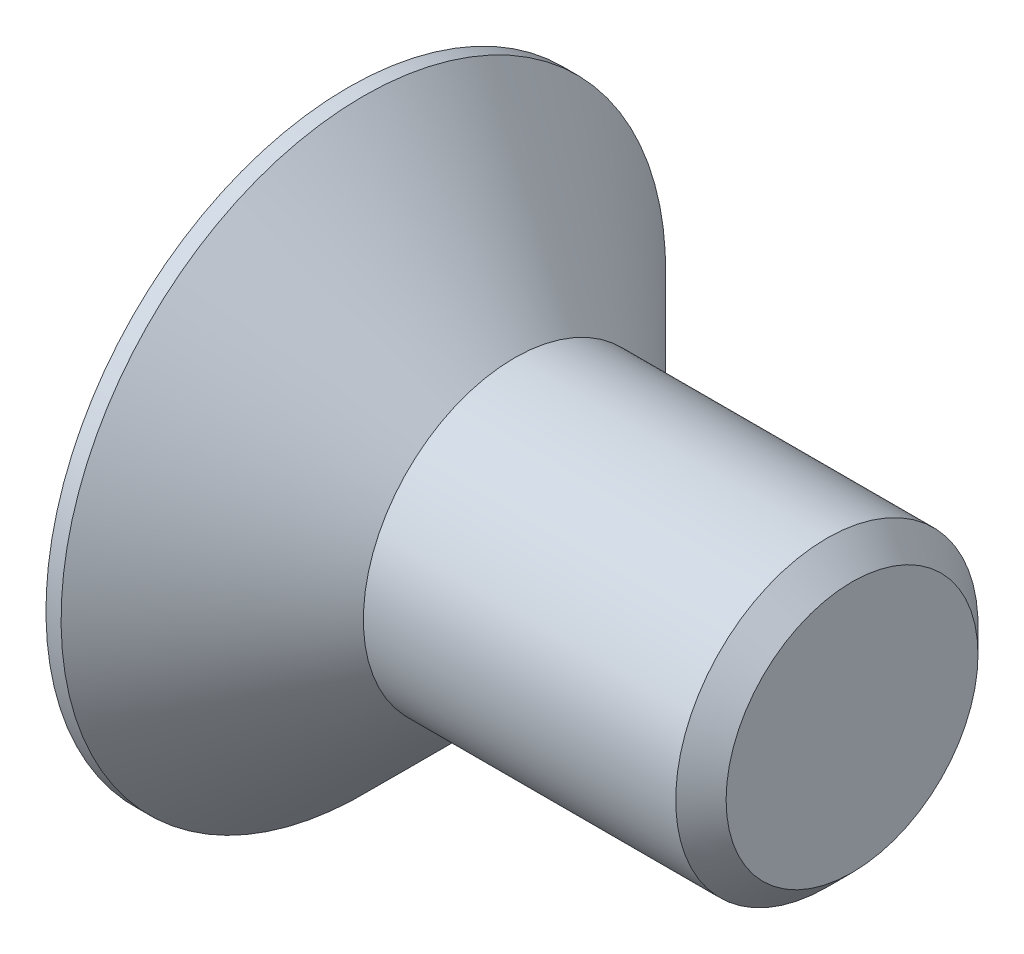
ISO-10303-21;
HEADER;
FILE_DESCRIPTION(('STEP AP214'),'2;1');
FILE_NAME('part.step','',(''),(''),'','','');
FILE_SCHEMA(('AUTOMOTIVE_DESIGN { 1 0 10303 214 1 1 1 1 }'));
ENDSEC;
DATA;
#1=APPLICATION_CONTEXT('core data for automotive mechanical design processes');
#2=APPLICATION_PROTOCOL_DEFINITION('international standard','automotive_design',2000,#1);
#3=PRODUCT_CONTEXT('',#1,'mechanical');
#4=PRODUCT('Part','Part','',(#3));
#5=PRODUCT_RELATED_PRODUCT_CATEGORY('part','',(#4));
#6=PRODUCT_DEFINITION_FORMATION('','',#4);
#7=PRODUCT_DEFINITION_CONTEXT('part definition',#1,'design');
#8=PRODUCT_DEFINITION('design','',#6,#7);
#9=PRODUCT_DEFINITION_SHAPE('','',#8);
#10=(LENGTH_UNIT() NAMED_UNIT(*) SI_UNIT(.MILLI.,.METRE.));
#11=(NAMED_UNIT(*) PLANE_ANGLE_UNIT() SI_UNIT($,.RADIAN.));
#12=(NAMED_UNIT(*) SI_UNIT($,.STERADIAN.) SOLID_ANGLE_UNIT());
#13=UNCERTAINTY_MEASURE_WITH_UNIT(LENGTH_MEASURE(1.E-05),#10,'distance_accuracy_value','');
#14=(GEOMETRIC_REPRESENTATION_CONTEXT(3) GLOBAL_UNCERTAINTY_ASSIGNED_CONTEXT((#13)) GLOBAL_UNIT_ASSIGNED_CONTEXT((#10,
#11,#12)) REPRESENTATION_CONTEXT('',''));
#15=CARTESIAN_POINT('',(0.,0.,0.));
#16=DIRECTION('',(0.,0.,1.));
#17=DIRECTION('',(1.,0.,0.));
#18=AXIS2_PLACEMENT_3D('',#15,#16,#17);
#19=CARTESIAN_POINT('',(0.,0.,0.));
#20=DIRECTION('',(-1.,0.,0.));
#21=DIRECTION('',(0.,-1.,0.));
#22=AXIS2_PLACEMENT_3D('',#19,#20,#21);
#23=PLANE('',#22);
#24=DIRECTION('',(0.,0.5,-0.866025403784438));
#25=VECTOR('',#24,1.);
#26=CARTESIAN_POINT('',(0.,1.15470053837925,2.));
#27=LINE('',#26,#25);
#28=CARTESIAN_POINT('',(0.,1.15470053837925,2.));
#29=VERTEX_POINT('',#28);
#30=CARTESIAN_POINT('',(0.,2.3094010767585,0.));
#31=VERTEX_POINT('',#30);
#32=EDGE_CURVE('E48',#29,#31,#27,.T.);
#33=ORIENTED_EDGE('',*,*,#32,.F.);
#34=DIRECTION('',(0.,1.,0.));
#35=VECTOR('',#34,1.);
#36=CARTESIAN_POINT('',(0.,-1.15470053837925,2.));
#37=LINE('',#36,#35);
#38=CARTESIAN_POINT('',(0.,-1.15470053837925,2.));
#39=VERTEX_POINT('',#38);
#40=EDGE_CURVE('E131',#39,#29,#37,.T.);
#41=ORIENTED_EDGE('',*,*,#40,.F.);
#42=DIRECTION('',(0.,0.5,0.866025403784439));
#43=VECTOR('',#42,1.);
#44=CARTESIAN_POINT('',(0.,-2.3094010767585,0.));
#45=LINE('',#44,#43);
#46=CARTESIAN_POINT('',(0.,-2.3094010767585,0.));
#47=VERTEX_POINT('',#46);
#48=EDGE_CURVE('E129',#47,#39,#45,.T.);
#49=ORIENTED_EDGE('',*,*,#48,.F.);
#50=DIRECTION('',(0.,-0.5,0.866025403784439));
#51=VECTOR('',#50,1.);
#52=CARTESIAN_POINT('',(0.,-1.15470053837925,-2.));
#53=LINE('',#52,#51);
#54=CARTESIAN_POINT('',(0.,-1.15470053837925,-2.));
#55=VERTEX_POINT('',#54);
#56=EDGE_CURVE('E96',#55,#47,#53,.T.);
#57=ORIENTED_EDGE('',*,*,#56,.F.);
#58=DIRECTION('',(0.,-1.,0.));
#59=VECTOR('',#58,1.);
#60=CARTESIAN_POINT('',(0.,1.15470053837925,-2.));
#61=LINE('',#60,#59);
#62=CARTESIAN_POINT('',(0.,1.15470053837925,-2.));
#63=VERTEX_POINT('',#62);
#64=EDGE_CURVE('E125',#63,#55,#61,.T.);
#65=ORIENTED_EDGE('',*,*,#64,.F.);
#66=DIRECTION('',(0.,-0.5,-0.866025403784439));
#67=VECTOR('',#66,1.);
#68=CARTESIAN_POINT('',(0.,2.3094010767585,0.));
#69=LINE('',#68,#67);
#70=EDGE_CURVE('E122',#31,#63,#69,.T.);
#71=ORIENTED_EDGE('',*,*,#70,.F.);
#72=EDGE_LOOP('',(#33,#41,#49,#57,#65,#71));
#73=FACE_BOUND('',#72,.T.);
#74=CARTESIAN_POINT('',(0.,0.,0.));
#75=DIRECTION('',(1.,0.,0.));
#76=DIRECTION('',(0.,1.,0.));
#77=AXIS2_PLACEMENT_3D('',#74,#75,#76);
#78=CIRCLE('',#77,6.);
#79=CARTESIAN_POINT('',(0.,6.,0.));
#80=VERTEX_POINT('',#79);
#81=EDGE_CURVE('E146',#80,#80,#78,.T.);
#82=ORIENTED_EDGE('',*,*,#81,.F.);
#83=EDGE_LOOP('',(#82));
#84=FACE_BOUND('',#83,.T.);
#85=ADVANCED_FACE('F33',(#73,#84),#23,.T.);
#86=CARTESIAN_POINT('',(10.,0.,0.));
#87=DIRECTION('',(1.,0.,0.));
#88=DIRECTION('',(0.,1.,0.));
#89=AXIS2_PLACEMENT_3D('',#86,#87,#88);
#90=CYLINDRICAL_SURFACE('',#89,6.);
#91=ORIENTED_EDGE('',*,*,#81,.T.);
#92=EDGE_LOOP('',(#91));
#93=FACE_BOUND('',#92,.T.);
#94=CARTESIAN_POINT('',(0.299999999999927,0.,0.));
#95=DIRECTION('',(1.,0.,0.));
#96=DIRECTION('',(0.,1.,0.));
#97=AXIS2_PLACEMENT_3D('',#94,#95,#96);
#98=CIRCLE('',#97,6.);
#99=CARTESIAN_POINT('',(0.299999999999929,6.,0.));
#100=VERTEX_POINT('',#99);
#101=EDGE_CURVE('E143',#100,#100,#98,.T.);
#102=ORIENTED_EDGE('',*,*,#101,.F.);
#103=EDGE_LOOP('',(#102));
#104=FACE_BOUND('',#103,.T.);
#105=ADVANCED_FACE('F166',(#93,#104),#90,.T.);
#106=CARTESIAN_POINT('',(3.3,0.,0.));
#107=DIRECTION('',(-1.,0.,0.));
#108=DIRECTION('',(0.,-1.,0.));
#109=AXIS2_PLACEMENT_3D('',#106,#107,#108);
#110=CONICAL_SURFACE('',#109,3.,0.785398163397436);
#111=ORIENTED_EDGE('',*,*,#101,.T.);
#112=EDGE_LOOP('',(#111));
#113=FACE_BOUND('',#112,.T.);
#114=CARTESIAN_POINT('',(3.3,0.,0.));
#115=DIRECTION('',(1.,0.,0.));
#116=DIRECTION('',(0.,1.,0.));
#117=AXIS2_PLACEMENT_3D('',#114,#115,#116);
#118=CIRCLE('',#117,3.);
#119=CARTESIAN_POINT('',(3.3,3.,0.));
#120=VERTEX_POINT('',#119);
#121=EDGE_CURVE('E135',#120,#120,#118,.T.);
#122=ORIENTED_EDGE('',*,*,#121,.F.);
#123=EDGE_LOOP('',(#122));
#124=FACE_BOUND('',#123,.T.);
#125=ADVANCED_FACE('F171',(#113,#124),#110,.T.);
#126=CARTESIAN_POINT('',(10.,0.,0.));
#127=DIRECTION('',(1.,0.,0.));
#128=DIRECTION('',(0.,1.,0.));
#129=AXIS2_PLACEMENT_3D('',#126,#127,#128);
#130=CYLINDRICAL_SURFACE('',#129,3.);
#131=CARTESIAN_POINT('',(9.49999999999999,0.,0.));
#132=DIRECTION('',(1.,0.,0.));
#133=DIRECTION('',(0.,1.,0.));
#134=AXIS2_PLACEMENT_3D('',#131,#132,#133);
#135=CIRCLE('',#134,3.);
#136=CARTESIAN_POINT('',(9.5,3.,0.));
#137=VERTEX_POINT('',#136);
#138=EDGE_CURVE('E11',#137,#137,#135,.F.);
#139=ORIENTED_EDGE('',*,*,#138,.T.);
#140=EDGE_LOOP('',(#139));
#141=FACE_BOUND('',#140,.T.);
#142=ORIENTED_EDGE('',*,*,#121,.T.);
#143=EDGE_LOOP('',(#142));
#144=FACE_BOUND('',#143,.T.);
#145=ADVANCED_FACE('F162',(#141,#144),#130,.T.);
#146=CARTESIAN_POINT('',(10.,3.,0.));
#147=DIRECTION('',(1.,0.,0.));
#148=DIRECTION('',(0.,1.,0.));
#149=AXIS2_PLACEMENT_3D('',#146,#147,#148);
#150=PLANE('',#149);
#151=CARTESIAN_POINT('',(10.,0.,0.));
#152=DIRECTION('',(1.,0.,0.));
#153=DIRECTION('',(0.,1.,0.));
#154=AXIS2_PLACEMENT_3D('',#151,#152,#153);
#155=CIRCLE('',#154,2.49999999999999);
#156=CARTESIAN_POINT('',(10.,2.49999999999999,0.));
#157=VERTEX_POINT('',#156);
#158=EDGE_CURVE('E41',#157,#157,#155,.T.);
#159=ORIENTED_EDGE('',*,*,#158,.T.);
#160=EDGE_LOOP('',(#159));
#161=FACE_BOUND('',#160,.T.);
#162=ADVANCED_FACE('F151',(#161),#150,.T.);
#163=CARTESIAN_POINT('',(10.,0.,0.));
#164=DIRECTION('',(-1.,0.,0.));
#165=DIRECTION('',(0.,-1.,0.));
#166=AXIS2_PLACEMENT_3D('',#163,#164,#165);
#167=CONICAL_SURFACE('',#166,2.49999999999999,0.785398163397447);
#168=ORIENTED_EDGE('',*,*,#138,.F.);
#169=EDGE_LOOP('',(#168));
#170=FACE_BOUND('',#169,.T.);
#171=ORIENTED_EDGE('',*,*,#158,.F.);
#172=EDGE_LOOP('',(#171));
#173=FACE_BOUND('',#172,.T.);
#174=ADVANCED_FACE('F35',(#170,#173),#167,.T.);
#175=CARTESIAN_POINT('',(2.5,1.15470053837925,2.));
#176=DIRECTION('',(0.,0.866025403784439,0.5));
#177=DIRECTION('',(0.,-0.5,0.866025403784439));
#178=AXIS2_PLACEMENT_3D('',#175,#176,#177);
#179=PLANE('',#178);
#180=ORIENTED_EDGE('',*,*,#32,.T.);
#181=DIRECTION('',(-1.,0.,0.));
#182=VECTOR('',#181,1.);
#183=CARTESIAN_POINT('',(2.5,2.3094010767585,0.));
#184=LINE('',#183,#182);
#185=CARTESIAN_POINT('',(2.5,2.3094010767585,0.));
#186=VERTEX_POINT('',#185);
#187=EDGE_CURVE('E78',#186,#31,#184,.T.);
#188=ORIENTED_EDGE('',*,*,#187,.F.);
#189=DIRECTION('',(0.,0.5,-0.866025403784438));
#190=VECTOR('',#189,1.);
#191=CARTESIAN_POINT('',(2.5,1.15470053837925,2.));
#192=LINE('',#191,#190);
#193=CARTESIAN_POINT('',(2.5,1.15470053837925,2.));
#194=VERTEX_POINT('',#193);
#195=EDGE_CURVE('E133',#194,#186,#192,.T.);
#196=ORIENTED_EDGE('',*,*,#195,.F.);
#197=DIRECTION('',(-1.,0.,0.));
#198=VECTOR('',#197,1.);
#199=CARTESIAN_POINT('',(2.5,1.15470053837925,2.));
#200=LINE('',#199,#198);
#201=EDGE_CURVE('E56',#194,#29,#200,.T.);
#202=ORIENTED_EDGE('',*,*,#201,.T.);
#203=EDGE_LOOP('',(#180,#188,#196,#202));
#204=FACE_BOUND('',#203,.T.);
#205=ADVANCED_FACE('F154',(#204),#179,.F.);
#206=CARTESIAN_POINT('',(2.5,-1.15470053837925,2.));
#207=DIRECTION('',(0.,0.,1.));
#208=DIRECTION('',(0.,-1.,0.));
#209=AXIS2_PLACEMENT_3D('',#206,#207,#208);
#210=PLANE('',#209);
#211=ORIENTED_EDGE('',*,*,#40,.T.);
#212=ORIENTED_EDGE('',*,*,#201,.F.);
#213=DIRECTION('',(0.,1.,0.));
#214=VECTOR('',#213,1.);
#215=CARTESIAN_POINT('',(2.5,-1.15470053837925,2.));
#216=LINE('',#215,#214);
#217=CARTESIAN_POINT('',(2.5,-1.15470053837925,2.));
#218=VERTEX_POINT('',#217);
#219=EDGE_CURVE('E108',#218,#194,#216,.T.);
#220=ORIENTED_EDGE('',*,*,#219,.F.);
#221=DIRECTION('',(-1.,0.,0.));
#222=VECTOR('',#221,1.);
#223=CARTESIAN_POINT('',(2.5,-1.15470053837925,2.));
#224=LINE('',#223,#222);
#225=EDGE_CURVE('E100',#218,#39,#224,.T.);
#226=ORIENTED_EDGE('',*,*,#225,.T.);
#227=EDGE_LOOP('',(#211,#212,#220,#226));
#228=FACE_BOUND('',#227,.T.);
#229=ADVANCED_FACE('F160',(#228),#210,.F.);
#230=CARTESIAN_POINT('',(2.5,-2.3094010767585,0.));
#231=DIRECTION('',(0.,-0.866025403784439,0.5));
#232=DIRECTION('',(0.,-0.5,-0.866025403784439));
#233=AXIS2_PLACEMENT_3D('',#230,#231,#232);
#234=PLANE('',#233);
#235=ORIENTED_EDGE('',*,*,#48,.T.);
#236=ORIENTED_EDGE('',*,*,#225,.F.);
#237=DIRECTION('',(0.,0.5,0.866025403784439));
#238=VECTOR('',#237,1.);
#239=CARTESIAN_POINT('',(2.5,-2.3094010767585,0.));
#240=LINE('',#239,#238);
#241=CARTESIAN_POINT('',(2.5,-2.3094010767585,0.));
#242=VERTEX_POINT('',#241);
#243=EDGE_CURVE('E104',#242,#218,#240,.T.);
#244=ORIENTED_EDGE('',*,*,#243,.F.);
#245=DIRECTION('',(-1.,0.,0.));
#246=VECTOR('',#245,1.);
#247=CARTESIAN_POINT('',(2.5,-2.3094010767585,0.));
#248=LINE('',#247,#246);
#249=EDGE_CURVE('E89',#242,#47,#248,.T.);
#250=ORIENTED_EDGE('',*,*,#249,.T.);
#251=EDGE_LOOP('',(#235,#236,#244,#250));
#252=FACE_BOUND('',#251,.T.);
#253=ADVANCED_FACE('F105',(#252),#234,.F.);
#254=CARTESIAN_POINT('',(2.5,-1.15470053837925,-2.));
#255=DIRECTION('',(0.,-0.866025403784438,-0.5));
#256=DIRECTION('',(0.,0.5,-0.866025403784439));
#257=AXIS2_PLACEMENT_3D('',#254,#255,#256);
#258=PLANE('',#257);
#259=ORIENTED_EDGE('',*,*,#56,.T.);
#260=ORIENTED_EDGE('',*,*,#249,.F.);
#261=DIRECTION('',(0.,-0.5,0.866025403784439));
#262=VECTOR('',#261,1.);
#263=CARTESIAN_POINT('',(2.5,-1.15470053837925,-2.));
#264=LINE('',#263,#262);
#265=CARTESIAN_POINT('',(2.5,-1.15470053837925,-2.));
#266=VERTEX_POINT('',#265);
#267=EDGE_CURVE('E93',#266,#242,#264,.T.);
#268=ORIENTED_EDGE('',*,*,#267,.F.);
#269=DIRECTION('',(-1.,0.,0.));
#270=VECTOR('',#269,1.);
#271=CARTESIAN_POINT('',(2.5,-1.15470053837925,-2.));
#272=LINE('',#271,#270);
#273=EDGE_CURVE('E101',#266,#55,#272,.T.);
#274=ORIENTED_EDGE('',*,*,#273,.T.);
#275=EDGE_LOOP('',(#259,#260,#268,#274));
#276=FACE_BOUND('',#275,.T.);
#277=ADVANCED_FACE('F91',(#276),#258,.F.);
#278=CARTESIAN_POINT('',(2.5,1.15470053837925,-2.));
#279=DIRECTION('',(0.,0.,-1.));
#280=DIRECTION('',(-1.,0.,0.));
#281=AXIS2_PLACEMENT_3D('',#278,#279,#280);
#282=PLANE('',#281);
#283=ORIENTED_EDGE('',*,*,#64,.T.);
#284=ORIENTED_EDGE('',*,*,#273,.F.);
#285=DIRECTION('',(0.,-1.,0.));
#286=VECTOR('',#285,1.);
#287=CARTESIAN_POINT('',(2.5,1.15470053837925,-2.));
#288=LINE('',#287,#286);
#289=CARTESIAN_POINT('',(2.5,1.15470053837925,-2.));
#290=VERTEX_POINT('',#289);
#291=EDGE_CURVE('E114',#290,#266,#288,.T.);
#292=ORIENTED_EDGE('',*,*,#291,.F.);
#293=DIRECTION('',(-1.,0.,0.));
#294=VECTOR('',#293,1.);
#295=CARTESIAN_POINT('',(2.5,1.15470053837925,-2.));
#296=LINE('',#295,#294);
#297=EDGE_CURVE('E138',#290,#63,#296,.T.);
#298=ORIENTED_EDGE('',*,*,#297,.T.);
#299=EDGE_LOOP('',(#283,#284,#292,#298));
#300=FACE_BOUND('',#299,.T.);
#301=ADVANCED_FACE('F185',(#300),#282,.F.);
#302=CARTESIAN_POINT('',(2.5,2.3094010767585,0.));
#303=DIRECTION('',(0.,0.866025403784439,-0.5));
#304=DIRECTION('',(0.,0.5,0.866025403784439));
#305=AXIS2_PLACEMENT_3D('',#302,#303,#304);
#306=PLANE('',#305);
#307=ORIENTED_EDGE('',*,*,#70,.T.);
#308=ORIENTED_EDGE('',*,*,#297,.F.);
#309=DIRECTION('',(0.,-0.5,-0.866025403784439));
#310=VECTOR('',#309,1.);
#311=CARTESIAN_POINT('',(2.5,2.3094010767585,0.));
#312=LINE('',#311,#310);
#313=EDGE_CURVE('E116',#186,#290,#312,.T.);
#314=ORIENTED_EDGE('',*,*,#313,.F.);
#315=ORIENTED_EDGE('',*,*,#187,.T.);
#316=EDGE_LOOP('',(#307,#308,#314,#315));
#317=FACE_BOUND('',#316,.T.);
#318=ADVANCED_FACE('F182',(#317),#306,.F.);
#319=CARTESIAN_POINT('',(2.5,0.,0.));
#320=DIRECTION('',(-1.,0.,0.));
#321=DIRECTION('',(0.,-1.,0.));
#322=AXIS2_PLACEMENT_3D('',#319,#320,#321);
#323=PLANE('',#322);
#324=ORIENTED_EDGE('',*,*,#195,.T.);
#325=ORIENTED_EDGE('',*,*,#313,.T.);
#326=ORIENTED_EDGE('',*,*,#291,.T.);
#327=ORIENTED_EDGE('',*,*,#267,.T.);
#328=ORIENTED_EDGE('',*,*,#243,.T.);
#329=ORIENTED_EDGE('',*,*,#219,.T.);
#330=EDGE_LOOP('',(#324,#325,#326,#327,#328,#329));
#331=FACE_BOUND('',#330,.T.);
#332=ADVANCED_FACE('F111',(#331),#323,.T.);
#333=CLOSED_SHELL('',(#85,#105,#125,#145,#162,#174,#205,#229,#253,#277,#301,#318,#332));
#334=MANIFOLD_SOLID_BREP('B2',#333);
#335=ADVANCED_BREP_SHAPE_REPRESENTATION('',(#18,#334),#14);
#336=SHAPE_DEFINITION_REPRESENTATION(#9,#335);
ENDSEC;
END-ISO-10303-21;
